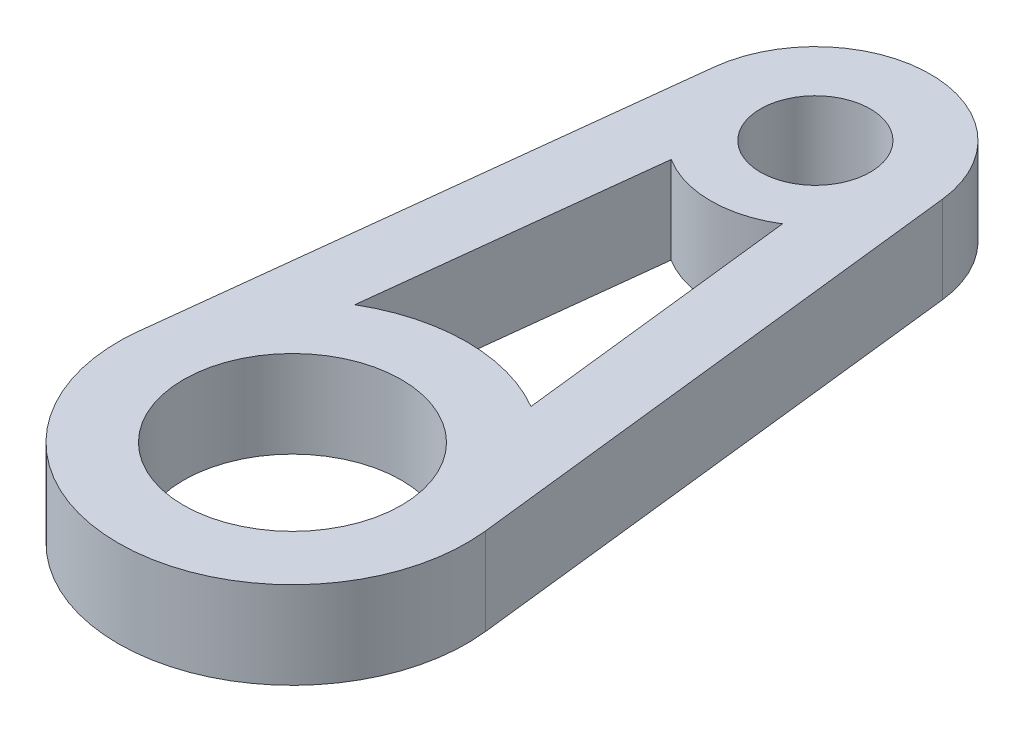
ISO-10303-21;
HEADER;
FILE_DESCRIPTION(('STEP AP214'),'2;1');
FILE_NAME('part.step','',(''),(''),'','','');
FILE_SCHEMA(('AUTOMOTIVE_DESIGN { 1 0 10303 214 1 1 1 1 }'));
ENDSEC;
DATA;
#1=APPLICATION_CONTEXT('core data for automotive mechanical design processes');
#2=APPLICATION_PROTOCOL_DEFINITION('international standard','automotive_design',2000,#1);
#3=PRODUCT_CONTEXT('',#1,'mechanical');
#4=PRODUCT('Part','Part','',(#3));
#5=PRODUCT_RELATED_PRODUCT_CATEGORY('part','',(#4));
#6=PRODUCT_DEFINITION_FORMATION('','',#4);
#7=PRODUCT_DEFINITION_CONTEXT('part definition',#1,'design');
#8=PRODUCT_DEFINITION('design','',#6,#7);
#9=PRODUCT_DEFINITION_SHAPE('','',#8);
#10=(LENGTH_UNIT() NAMED_UNIT(*) SI_UNIT(.MILLI.,.METRE.));
#11=(NAMED_UNIT(*) PLANE_ANGLE_UNIT() SI_UNIT($,.RADIAN.));
#12=(NAMED_UNIT(*) SI_UNIT($,.STERADIAN.) SOLID_ANGLE_UNIT());
#13=UNCERTAINTY_MEASURE_WITH_UNIT(LENGTH_MEASURE(1.E-05),#10,'distance_accuracy_value','');
#14=(GEOMETRIC_REPRESENTATION_CONTEXT(3) GLOBAL_UNCERTAINTY_ASSIGNED_CONTEXT((#13)) GLOBAL_UNIT_ASSIGNED_CONTEXT((#10,
#11,#12)) REPRESENTATION_CONTEXT('',''));
#15=CARTESIAN_POINT('',(0.,0.,0.));
#16=DIRECTION('',(0.,0.,1.));
#17=DIRECTION('',(1.,0.,0.));
#18=AXIS2_PLACEMENT_3D('',#15,#16,#17);
#19=CARTESIAN_POINT('',(0.,3.175,19.05));
#20=DIRECTION('',(0.,-1.,0.));
#21=DIRECTION('',(0.,0.,-1.));
#22=AXIS2_PLACEMENT_3D('',#19,#20,#21);
#23=PLANE('',#22);
#24=CARTESIAN_POINT('',(0.,3.175,0.));
#25=DIRECTION('',(0.,1.,0.));
#26=DIRECTION('',(0.,0.,1.));
#27=AXIS2_PLACEMENT_3D('',#24,#25,#26);
#28=CIRCLE('',#27,2.);
#29=CARTESIAN_POINT('',(0.,3.175,2.));
#30=VERTEX_POINT('',#29);
#31=EDGE_CURVE('E156',#30,#30,#28,.T.);
#32=ORIENTED_EDGE('',*,*,#31,.F.);
#33=EDGE_LOOP('',(#32));
#34=FACE_BOUND('',#33,.T.);
#35=CARTESIAN_POINT('',(0.,3.175,19.05));
#36=DIRECTION('',(0.,1.,0.));
#37=DIRECTION('',(0.,0.,-1.));
#38=AXIS2_PLACEMENT_3D('',#35,#36,#37);
#39=CIRCLE('',#38,6.35);
#40=CARTESIAN_POINT('',(-6.30908708838996,3.175,18.3303333333333));
#41=VERTEX_POINT('',#40);
#42=CARTESIAN_POINT('',(6.30908708838996,3.175,18.3303333333333));
#43=VERTEX_POINT('',#42);
#44=EDGE_CURVE('E164',#41,#43,#39,.T.);
#45=ORIENTED_EDGE('',*,*,#44,.T.);
#46=DIRECTION('',(-0.113333333333333,0.,-0.993557021793694));
#47=VECTOR('',#46,1.);
#48=CARTESIAN_POINT('',(4.16399747833737,3.175,-0.47498));
#49=LINE('',#48,#47);
#50=CARTESIAN_POINT('',(4.16399747833737,3.175,-0.474980000000002));
#51=VERTEX_POINT('',#50);
#52=EDGE_CURVE('E168',#43,#51,#49,.T.);
#53=ORIENTED_EDGE('',*,*,#52,.T.);
#54=CARTESIAN_POINT('',(0.,3.175,0.));
#55=DIRECTION('',(0.,1.,0.));
#56=DIRECTION('',(0.,0.,-1.));
#57=AXIS2_PLACEMENT_3D('',#54,#55,#56);
#58=CIRCLE('',#57,4.191);
#59=CARTESIAN_POINT('',(-4.16399747833737,3.175,-0.47498));
#60=VERTEX_POINT('',#59);
#61=EDGE_CURVE('E172',#51,#60,#58,.T.);
#62=ORIENTED_EDGE('',*,*,#61,.T.);
#63=DIRECTION('',(-0.113333333333333,0.,0.993557021793694));
#64=VECTOR('',#63,1.);
#65=CARTESIAN_POINT('',(-4.16399747833737,3.175,-0.47498));
#66=LINE('',#65,#64);
#67=EDGE_CURVE('E175',#60,#41,#66,.T.);
#68=ORIENTED_EDGE('',*,*,#67,.T.);
#69=EDGE_LOOP('',(#45,#53,#62,#68));
#70=FACE_BOUND('',#69,.T.);
#71=CARTESIAN_POINT('',(0.,3.175,19.05));
#72=DIRECTION('',(0.,-1.,0.));
#73=DIRECTION('',(0.,0.,1.));
#74=AXIS2_PLACEMENT_3D('',#71,#72,#73);
#75=CIRCLE('',#74,6.35);
#76=CARTESIAN_POINT('',(-3.20971891970064,3.175,13.570930329288));
#77=VERTEX_POINT('',#76);
#78=CARTESIAN_POINT('',(3.20971891970064,3.175,13.570930329288));
#79=VERTEX_POINT('',#78);
#80=EDGE_CURVE('E104',#77,#79,#75,.T.);
#81=ORIENTED_EDGE('',*,*,#80,.F.);
#82=DIRECTION('',(-0.113333333333333,0.,0.993557021793694));
#83=VECTOR('',#82,1.);
#84=CARTESIAN_POINT('',(-3.20971891970064,3.175,13.570930329288));
#85=LINE('',#84,#83);
#86=CARTESIAN_POINT('',(-2.02951536427329,3.175,3.22446389128157));
#87=VERTEX_POINT('',#86);
#88=EDGE_CURVE('E132',#87,#77,#85,.T.);
#89=ORIENTED_EDGE('',*,*,#88,.F.);
#90=CARTESIAN_POINT('',(0.,3.175,0.));
#91=DIRECTION('',(0.,-1.,0.));
#92=DIRECTION('',(0.,0.,-1.));
#93=AXIS2_PLACEMENT_3D('',#90,#91,#92);
#94=CIRCLE('',#93,3.81);
#95=CARTESIAN_POINT('',(2.02951536427329,3.175,3.22446389128157));
#96=VERTEX_POINT('',#95);
#97=EDGE_CURVE('E127',#96,#87,#94,.T.);
#98=ORIENTED_EDGE('',*,*,#97,.F.);
#99=DIRECTION('',(-0.113333333333333,0.,-0.993557021793694));
#100=VECTOR('',#99,1.);
#101=CARTESIAN_POINT('',(3.20971891970064,3.175,13.570930329288));
#102=LINE('',#101,#100);
#103=EDGE_CURVE('E113',#79,#96,#102,.T.);
#104=ORIENTED_EDGE('',*,*,#103,.F.);
#105=EDGE_LOOP('',(#81,#89,#98,#104));
#106=FACE_BOUND('',#105,.T.);
#107=CARTESIAN_POINT('',(0.,3.175,19.05));
#108=DIRECTION('',(0.,1.,0.));
#109=DIRECTION('',(0.,0.,1.));
#110=AXIS2_PLACEMENT_3D('',#107,#108,#109);
#111=CIRCLE('',#110,3.96875);
#112=CARTESIAN_POINT('',(0.,3.175,23.01875));
#113=VERTEX_POINT('',#112);
#114=EDGE_CURVE('E140',#113,#113,#111,.T.);
#115=ORIENTED_EDGE('',*,*,#114,.F.);
#116=EDGE_LOOP('',(#115));
#117=FACE_BOUND('',#116,.T.);
#118=ADVANCED_FACE('F38',(#34,#70,#106,#117),#23,.F.);
#119=CARTESIAN_POINT('',(0.,0.,19.05));
#120=DIRECTION('',(0.,-1.,0.));
#121=DIRECTION('',(0.,0.,-1.));
#122=AXIS2_PLACEMENT_3D('',#119,#120,#121);
#123=PLANE('',#122);
#124=DIRECTION('',(-0.113333333333333,0.,0.993557021793694));
#125=VECTOR('',#124,1.);
#126=CARTESIAN_POINT('',(-3.20971891970064,0.,13.570930329288));
#127=LINE('',#126,#125);
#128=CARTESIAN_POINT('',(-2.02951536427329,0.,3.22446389128157));
#129=VERTEX_POINT('',#128);
#130=CARTESIAN_POINT('',(-3.20971891970064,0.,13.570930329288));
#131=VERTEX_POINT('',#130);
#132=EDGE_CURVE('E114',#129,#131,#127,.T.);
#133=ORIENTED_EDGE('',*,*,#132,.T.);
#134=CARTESIAN_POINT('',(0.,0.,19.05));
#135=DIRECTION('',(0.,-1.,0.));
#136=DIRECTION('',(0.,0.,1.));
#137=AXIS2_PLACEMENT_3D('',#134,#135,#136);
#138=CIRCLE('',#137,6.35);
#139=CARTESIAN_POINT('',(3.20971891970064,0.,13.570930329288));
#140=VERTEX_POINT('',#139);
#141=EDGE_CURVE('E62',#131,#140,#138,.T.);
#142=ORIENTED_EDGE('',*,*,#141,.T.);
#143=DIRECTION('',(-0.113333333333333,0.,-0.993557021793694));
#144=VECTOR('',#143,1.);
#145=CARTESIAN_POINT('',(3.20971891970064,0.,13.570930329288));
#146=LINE('',#145,#144);
#147=CARTESIAN_POINT('',(2.02951536427329,0.,3.22446389128157));
#148=VERTEX_POINT('',#147);
#149=EDGE_CURVE('E120',#140,#148,#146,.T.);
#150=ORIENTED_EDGE('',*,*,#149,.T.);
#151=CARTESIAN_POINT('',(0.,0.,0.));
#152=DIRECTION('',(0.,-1.,0.));
#153=DIRECTION('',(0.,0.,-1.));
#154=AXIS2_PLACEMENT_3D('',#151,#152,#153);
#155=CIRCLE('',#154,3.81);
#156=EDGE_CURVE('E143',#148,#129,#155,.T.);
#157=ORIENTED_EDGE('',*,*,#156,.T.);
#158=EDGE_LOOP('',(#133,#142,#150,#157));
#159=FACE_BOUND('',#158,.T.);
#160=CARTESIAN_POINT('',(0.,0.,0.));
#161=DIRECTION('',(0.,1.,0.));
#162=DIRECTION('',(0.,0.,1.));
#163=AXIS2_PLACEMENT_3D('',#160,#161,#162);
#164=CIRCLE('',#163,2.);
#165=CARTESIAN_POINT('',(0.,0.,2.));
#166=VERTEX_POINT('',#165);
#167=EDGE_CURVE('E122',#166,#166,#164,.T.);
#168=ORIENTED_EDGE('',*,*,#167,.T.);
#169=EDGE_LOOP('',(#168));
#170=FACE_BOUND('',#169,.T.);
#171=CARTESIAN_POINT('',(0.,0.,19.05));
#172=DIRECTION('',(0.,1.,0.));
#173=DIRECTION('',(0.,0.,-1.));
#174=AXIS2_PLACEMENT_3D('',#171,#172,#173);
#175=CIRCLE('',#174,6.35);
#176=CARTESIAN_POINT('',(-6.30908708838996,0.,18.3303333333333));
#177=VERTEX_POINT('',#176);
#178=CARTESIAN_POINT('',(6.30908708838996,0.,18.3303333333333));
#179=VERTEX_POINT('',#178);
#180=EDGE_CURVE('E160',#177,#179,#175,.T.);
#181=ORIENTED_EDGE('',*,*,#180,.F.);
#182=DIRECTION('',(-0.113333333333333,0.,0.993557021793694));
#183=VECTOR('',#182,1.);
#184=CARTESIAN_POINT('',(-4.16399747833737,0.,-0.47498));
#185=LINE('',#184,#183);
#186=CARTESIAN_POINT('',(-4.16399747833737,0.,-0.47498));
#187=VERTEX_POINT('',#186);
#188=EDGE_CURVE('E169',#187,#177,#185,.T.);
#189=ORIENTED_EDGE('',*,*,#188,.F.);
#190=CARTESIAN_POINT('',(0.,0.,0.));
#191=DIRECTION('',(0.,1.,0.));
#192=DIRECTION('',(0.,0.,-1.));
#193=AXIS2_PLACEMENT_3D('',#190,#191,#192);
#194=CIRCLE('',#193,4.191);
#195=CARTESIAN_POINT('',(4.16399747833737,0.,-0.474980000000002));
#196=VERTEX_POINT('',#195);
#197=EDGE_CURVE('E185',#196,#187,#194,.T.);
#198=ORIENTED_EDGE('',*,*,#197,.F.);
#199=DIRECTION('',(-0.113333333333333,0.,-0.993557021793694));
#200=VECTOR('',#199,1.);
#201=CARTESIAN_POINT('',(4.16399747833737,0.,-0.47498));
#202=LINE('',#201,#200);
#203=EDGE_CURVE('E182',#179,#196,#202,.T.);
#204=ORIENTED_EDGE('',*,*,#203,.F.);
#205=EDGE_LOOP('',(#181,#189,#198,#204));
#206=FACE_BOUND('',#205,.T.);
#207=CARTESIAN_POINT('',(0.,0.,19.05));
#208=DIRECTION('',(0.,1.,0.));
#209=DIRECTION('',(0.,0.,1.));
#210=AXIS2_PLACEMENT_3D('',#207,#208,#209);
#211=CIRCLE('',#210,3.96875);
#212=CARTESIAN_POINT('',(0.,0.,23.01875));
#213=VERTEX_POINT('',#212);
#214=EDGE_CURVE('E272',#213,#213,#211,.T.);
#215=ORIENTED_EDGE('',*,*,#214,.T.);
#216=EDGE_LOOP('',(#215));
#217=FACE_BOUND('',#216,.T.);
#218=ADVANCED_FACE('F209',(#159,#170,#206,#217),#123,.T.);
#219=CARTESIAN_POINT('',(0.,3.175,19.05));
#220=DIRECTION('',(0.,-1.,0.));
#221=DIRECTION('',(0.,0.,-1.));
#222=AXIS2_PLACEMENT_3D('',#219,#220,#221);
#223=CYLINDRICAL_SURFACE('',#222,6.35);
#224=ORIENTED_EDGE('',*,*,#180,.T.);
#225=DIRECTION('',(0.,-1.,0.));
#226=VECTOR('',#225,1.);
#227=CARTESIAN_POINT('',(6.30908708838996,3.175,18.3303333333333));
#228=LINE('',#227,#226);
#229=EDGE_CURVE('E11',#43,#179,#228,.T.);
#230=ORIENTED_EDGE('',*,*,#229,.F.);
#231=ORIENTED_EDGE('',*,*,#44,.F.);
#232=DIRECTION('',(0.,-1.,0.));
#233=VECTOR('',#232,1.);
#234=CARTESIAN_POINT('',(-6.30908708838996,3.175,18.3303333333333));
#235=LINE('',#234,#233);
#236=EDGE_CURVE('E178',#41,#177,#235,.T.);
#237=ORIENTED_EDGE('',*,*,#236,.T.);
#238=EDGE_LOOP('',(#224,#230,#231,#237));
#239=FACE_BOUND('',#238,.T.);
#240=ADVANCED_FACE('F40',(#239),#223,.T.);
#241=CARTESIAN_POINT('',(4.16399747833737,3.175,-0.47498));
#242=DIRECTION('',(-0.993557021793694,0.,0.113333333333333));
#243=DIRECTION('',(0.113333333333333,0.,0.993557021793694));
#244=AXIS2_PLACEMENT_3D('',#241,#242,#243);
#245=PLANE('',#244);
#246=ORIENTED_EDGE('',*,*,#203,.T.);
#247=DIRECTION('',(0.,-1.,0.));
#248=VECTOR('',#247,1.);
#249=CARTESIAN_POINT('',(4.16399747833737,3.175,-0.474980000000002));
#250=LINE('',#249,#248);
#251=EDGE_CURVE('E47',#51,#196,#250,.T.);
#252=ORIENTED_EDGE('',*,*,#251,.F.);
#253=ORIENTED_EDGE('',*,*,#52,.F.);
#254=ORIENTED_EDGE('',*,*,#229,.T.);
#255=EDGE_LOOP('',(#246,#252,#253,#254));
#256=FACE_BOUND('',#255,.T.);
#257=ADVANCED_FACE('F219',(#256),#245,.F.);
#258=CARTESIAN_POINT('',(0.,3.175,0.));
#259=DIRECTION('',(0.,-1.,0.));
#260=DIRECTION('',(0.,0.,-1.));
#261=AXIS2_PLACEMENT_3D('',#258,#259,#260);
#262=CYLINDRICAL_SURFACE('',#261,4.191);
#263=ORIENTED_EDGE('',*,*,#197,.T.);
#264=DIRECTION('',(0.,-1.,0.));
#265=VECTOR('',#264,1.);
#266=CARTESIAN_POINT('',(-4.16399747833737,3.175,-0.47498));
#267=LINE('',#266,#265);
#268=EDGE_CURVE('E193',#60,#187,#267,.T.);
#269=ORIENTED_EDGE('',*,*,#268,.F.);
#270=ORIENTED_EDGE('',*,*,#61,.F.);
#271=ORIENTED_EDGE('',*,*,#251,.T.);
#272=EDGE_LOOP('',(#263,#269,#270,#271));
#273=FACE_BOUND('',#272,.T.);
#274=ADVANCED_FACE('F203',(#273),#262,.T.);
#275=CARTESIAN_POINT('',(-4.16399747833737,3.175,-0.47498));
#276=DIRECTION('',(0.993557021793694,0.,0.113333333333333));
#277=DIRECTION('',(0.113333333333333,0.,-0.993557021793694));
#278=AXIS2_PLACEMENT_3D('',#275,#276,#277);
#279=PLANE('',#278);
#280=ORIENTED_EDGE('',*,*,#188,.T.);
#281=ORIENTED_EDGE('',*,*,#236,.F.);
#282=ORIENTED_EDGE('',*,*,#67,.F.);
#283=ORIENTED_EDGE('',*,*,#268,.T.);
#284=EDGE_LOOP('',(#280,#281,#282,#283));
#285=FACE_BOUND('',#284,.T.);
#286=ADVANCED_FACE('F213',(#285),#279,.F.);
#287=CARTESIAN_POINT('',(0.,3.175,0.));
#288=DIRECTION('',(0.,-1.,0.));
#289=DIRECTION('',(0.,0.,-1.));
#290=AXIS2_PLACEMENT_3D('',#287,#288,#289);
#291=CYLINDRICAL_SURFACE('',#290,2.);
#292=ORIENTED_EDGE('',*,*,#31,.T.);
#293=EDGE_LOOP('',(#292));
#294=FACE_BOUND('',#293,.T.);
#295=ORIENTED_EDGE('',*,*,#167,.F.);
#296=EDGE_LOOP('',(#295));
#297=FACE_BOUND('',#296,.T.);
#298=ADVANCED_FACE('F236',(#294,#297),#291,.F.);
#299=CARTESIAN_POINT('',(0.,3.175,19.05));
#300=DIRECTION('',(0.,-1.,0.));
#301=DIRECTION('',(0.,0.,-1.));
#302=AXIS2_PLACEMENT_3D('',#299,#300,#301);
#303=CYLINDRICAL_SURFACE('',#302,6.35);
#304=ORIENTED_EDGE('',*,*,#141,.F.);
#305=DIRECTION('',(0.,-1.,0.));
#306=VECTOR('',#305,1.);
#307=CARTESIAN_POINT('',(-3.20971891970064,3.175,13.570930329288));
#308=LINE('',#307,#306);
#309=EDGE_CURVE('E108',#77,#131,#308,.T.);
#310=ORIENTED_EDGE('',*,*,#309,.F.);
#311=ORIENTED_EDGE('',*,*,#80,.T.);
#312=DIRECTION('',(0.,-1.,0.));
#313=VECTOR('',#312,1.);
#314=CARTESIAN_POINT('',(3.20971891970064,3.175,13.570930329288));
#315=LINE('',#314,#313);
#316=EDGE_CURVE('E107',#79,#140,#315,.T.);
#317=ORIENTED_EDGE('',*,*,#316,.T.);
#318=EDGE_LOOP('',(#304,#310,#311,#317));
#319=FACE_BOUND('',#318,.T.);
#320=ADVANCED_FACE('F106',(#319),#303,.T.);
#321=CARTESIAN_POINT('',(3.20971891970064,3.175,13.570930329288));
#322=DIRECTION('',(-0.993557021793694,0.,0.113333333333333));
#323=DIRECTION('',(0.113333333333333,0.,0.993557021793694));
#324=AXIS2_PLACEMENT_3D('',#321,#322,#323);
#325=PLANE('',#324);
#326=ORIENTED_EDGE('',*,*,#149,.F.);
#327=ORIENTED_EDGE('',*,*,#316,.F.);
#328=ORIENTED_EDGE('',*,*,#103,.T.);
#329=DIRECTION('',(0.,-1.,0.));
#330=VECTOR('',#329,1.);
#331=CARTESIAN_POINT('',(2.02951536427329,3.175,3.22446389128157));
#332=LINE('',#331,#330);
#333=EDGE_CURVE('E123',#96,#148,#332,.T.);
#334=ORIENTED_EDGE('',*,*,#333,.T.);
#335=EDGE_LOOP('',(#326,#327,#328,#334));
#336=FACE_BOUND('',#335,.T.);
#337=ADVANCED_FACE('F117',(#336),#325,.T.);
#338=CARTESIAN_POINT('',(0.,3.175,0.));
#339=DIRECTION('',(0.,-1.,0.));
#340=DIRECTION('',(0.,0.,-1.));
#341=AXIS2_PLACEMENT_3D('',#338,#339,#340);
#342=CYLINDRICAL_SURFACE('',#341,3.81);
#343=ORIENTED_EDGE('',*,*,#156,.F.);
#344=ORIENTED_EDGE('',*,*,#333,.F.);
#345=ORIENTED_EDGE('',*,*,#97,.T.);
#346=DIRECTION('',(0.,-1.,0.));
#347=VECTOR('',#346,1.);
#348=CARTESIAN_POINT('',(-2.02951536427329,3.175,3.22446389128157));
#349=LINE('',#348,#347);
#350=EDGE_CURVE('E54',#87,#129,#349,.T.);
#351=ORIENTED_EDGE('',*,*,#350,.T.);
#352=EDGE_LOOP('',(#343,#344,#345,#351));
#353=FACE_BOUND('',#352,.T.);
#354=ADVANCED_FACE('F253',(#353),#342,.T.);
#355=CARTESIAN_POINT('',(-3.20971891970064,3.175,13.570930329288));
#356=DIRECTION('',(0.993557021793694,0.,0.113333333333333));
#357=DIRECTION('',(0.113333333333333,0.,-0.993557021793694));
#358=AXIS2_PLACEMENT_3D('',#355,#356,#357);
#359=PLANE('',#358);
#360=ORIENTED_EDGE('',*,*,#132,.F.);
#361=ORIENTED_EDGE('',*,*,#350,.F.);
#362=ORIENTED_EDGE('',*,*,#88,.T.);
#363=ORIENTED_EDGE('',*,*,#309,.T.);
#364=EDGE_LOOP('',(#360,#361,#362,#363));
#365=FACE_BOUND('',#364,.T.);
#366=ADVANCED_FACE('F258',(#365),#359,.T.);
#367=CARTESIAN_POINT('',(0.,3.175,19.05));
#368=DIRECTION('',(0.,-1.,0.));
#369=DIRECTION('',(0.,0.,-1.));
#370=AXIS2_PLACEMENT_3D('',#367,#368,#369);
#371=CYLINDRICAL_SURFACE('',#370,3.96875);
#372=ORIENTED_EDGE('',*,*,#114,.T.);
#373=EDGE_LOOP('',(#372));
#374=FACE_BOUND('',#373,.T.);
#375=ORIENTED_EDGE('',*,*,#214,.F.);
#376=EDGE_LOOP('',(#375));
#377=FACE_BOUND('',#376,.T.);
#378=ADVANCED_FACE('F262',(#374,#377),#371,.F.);
#379=CLOSED_SHELL('',(#118,#218,#240,#257,#274,#286,#298,#320,#337,#354,#366,#378));
#380=MANIFOLD_SOLID_BREP('B2',#379);
#381=ADVANCED_BREP_SHAPE_REPRESENTATION('',(#18,#380),#14);
#382=SHAPE_DEFINITION_REPRESENTATION(#9,#381);
ENDSEC;
END-ISO-10303-21;
